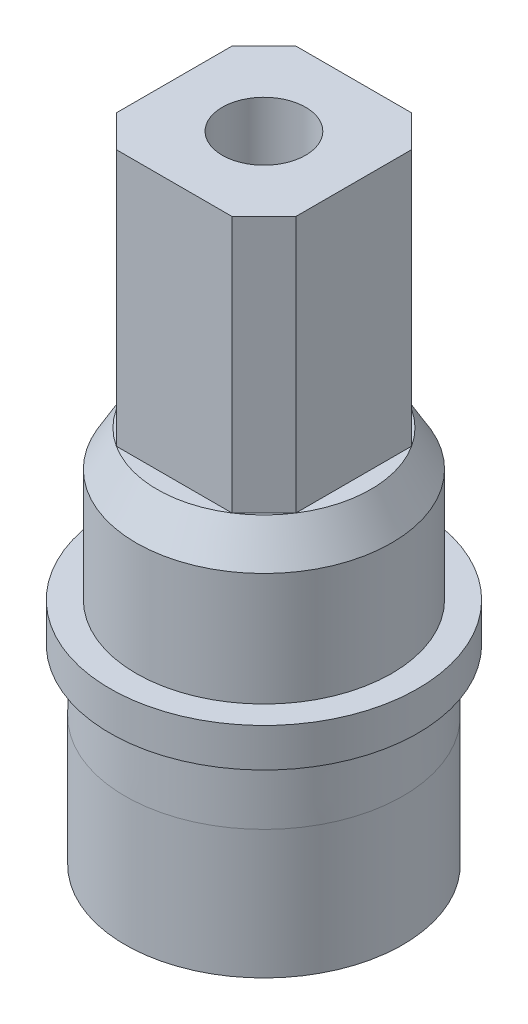
ISO-10303-21;
HEADER;
FILE_DESCRIPTION(('STEP AP214'),'2;1');
FILE_NAME('part.step','',(''),(''),'','','');
FILE_SCHEMA(('AUTOMOTIVE_DESIGN { 1 0 10303 214 1 1 1 1 }'));
ENDSEC;
DATA;
#1=APPLICATION_CONTEXT('core data for automotive mechanical design processes');
#2=APPLICATION_PROTOCOL_DEFINITION('international standard','automotive_design',2000,#1);
#3=PRODUCT_CONTEXT('',#1,'mechanical');
#4=PRODUCT('Part','Part','',(#3));
#5=PRODUCT_RELATED_PRODUCT_CATEGORY('part','',(#4));
#6=PRODUCT_DEFINITION_FORMATION('','',#4);
#7=PRODUCT_DEFINITION_CONTEXT('part definition',#1,'design');
#8=PRODUCT_DEFINITION('design','',#6,#7);
#9=PRODUCT_DEFINITION_SHAPE('','',#8);
#10=(LENGTH_UNIT() NAMED_UNIT(*) SI_UNIT(.MILLI.,.METRE.));
#11=(NAMED_UNIT(*) PLANE_ANGLE_UNIT() SI_UNIT($,.RADIAN.));
#12=(NAMED_UNIT(*) SI_UNIT($,.STERADIAN.) SOLID_ANGLE_UNIT());
#13=UNCERTAINTY_MEASURE_WITH_UNIT(LENGTH_MEASURE(1.E-05),#10,'distance_accuracy_value','');
#14=(GEOMETRIC_REPRESENTATION_CONTEXT(3) GLOBAL_UNCERTAINTY_ASSIGNED_CONTEXT((#13)) GLOBAL_UNIT_ASSIGNED_CONTEXT((#10,
#11,#12)) REPRESENTATION_CONTEXT('',''));
#15=CARTESIAN_POINT('',(0.,0.,0.));
#16=DIRECTION('',(0.,0.,1.));
#17=DIRECTION('',(1.,0.,0.));
#18=AXIS2_PLACEMENT_3D('',#15,#16,#17);
#19=CARTESIAN_POINT('',(0.,-7.46,0.));
#20=DIRECTION('',(0.,1.,0.));
#21=DIRECTION('',(0.,0.,1.));
#22=AXIS2_PLACEMENT_3D('',#19,#20,#21);
#23=CYLINDRICAL_SURFACE('',#22,4.315);
#24=CARTESIAN_POINT('',(0.,0.54,0.));
#25=DIRECTION('',(0.,-1.,0.));
#26=DIRECTION('',(0.,0.,-1.));
#27=AXIS2_PLACEMENT_3D('',#24,#25,#26);
#28=CIRCLE('',#27,4.315);
#29=CARTESIAN_POINT('',(0.,0.54,-4.315));
#30=VERTEX_POINT('',#29);
#31=EDGE_CURVE('E83',#30,#30,#28,.T.);
#32=ORIENTED_EDGE('',*,*,#31,.T.);
#33=EDGE_LOOP('',(#32));
#34=FACE_BOUND('',#33,.T.);
#35=CARTESIAN_POINT('',(0.,-3.46,0.));
#36=DIRECTION('',(0.,-1.,0.));
#37=DIRECTION('',(0.,0.,-1.));
#38=AXIS2_PLACEMENT_3D('',#35,#36,#37);
#39=CIRCLE('',#38,4.315);
#40=CARTESIAN_POINT('',(0.,-3.46,-4.315));
#41=VERTEX_POINT('',#40);
#42=EDGE_CURVE('E78',#41,#41,#39,.T.);
#43=ORIENTED_EDGE('',*,*,#42,.F.);
#44=EDGE_LOOP('',(#43));
#45=FACE_BOUND('',#44,.T.);
#46=ADVANCED_FACE('F44',(#34,#45),#23,.T.);
#47=CARTESIAN_POINT('',(0.089910847244246,2.74,-1.19662694251292));
#48=DIRECTION('',(0.0749257060368717,0.,-0.997189118760768));
#49=DIRECTION('',(-0.997189118760768,0.,-0.0749257060368717));
#50=AXIS2_PLACEMENT_3D('',#47,#48,#49);
#51=PLANE('',#50);
#52=DIRECTION('',(-0.997189118760768,0.,-0.0749257060368717));
#53=VECTOR('',#52,1.);
#54=CARTESIAN_POINT('',(0.089910847244246,-3.46,-1.19662694251292));
#55=LINE('',#54,#53);
#56=CARTESIAN_POINT('',(1.14523661458051,-3.46,-1.11733302852112));
#57=VERTEX_POINT('',#56);
#58=CARTESIAN_POINT('',(-0.965414920092013,-3.46,-1.27592085650472));
#59=VERTEX_POINT('',#58);
#60=EDGE_CURVE('E57',#57,#59,#55,.T.);
#61=ORIENTED_EDGE('',*,*,#60,.F.);
#62=DIRECTION('',(0.,-1.,0.));
#63=VECTOR('',#62,1.);
#64=CARTESIAN_POINT('',(1.1452366145805,2.74,-1.11733302852112));
#65=LINE('',#64,#63);
#66=CARTESIAN_POINT('',(1.1452366145805,0.54,-1.11733302852112));
#67=VERTEX_POINT('',#66);
#68=EDGE_CURVE('E77',#67,#57,#65,.T.);
#69=ORIENTED_EDGE('',*,*,#68,.F.);
#70=DIRECTION('',(0.997189118760768,0.,0.0749257060368717));
#71=VECTOR('',#70,1.);
#72=CARTESIAN_POINT('',(0.089910847244246,0.54,-1.19662694251292));
#73=LINE('',#72,#71);
#74=CARTESIAN_POINT('',(-0.965414920092012,0.54,-1.27592085650472));
#75=VERTEX_POINT('',#74);
#76=EDGE_CURVE('E12',#75,#67,#73,.T.);
#77=ORIENTED_EDGE('',*,*,#76,.F.);
#78=DIRECTION('',(0.,-1.,0.));
#79=VECTOR('',#78,1.);
#80=CARTESIAN_POINT('',(-0.965414920092013,2.74,-1.27592085650472));
#81=LINE('',#80,#79);
#82=EDGE_CURVE('E64',#75,#59,#81,.T.);
#83=ORIENTED_EDGE('',*,*,#82,.T.);
#84=EDGE_LOOP('',(#61,#69,#77,#83));
#85=FACE_BOUND('',#84,.T.);
#86=ADVANCED_FACE('F76',(#85),#51,.F.);
#87=CARTESIAN_POINT('',(0.,2.74,0.));
#88=DIRECTION('',(0.,-1.,0.));
#89=DIRECTION('',(0.,0.,-1.));
#90=AXIS2_PLACEMENT_3D('',#87,#88,#89);
#91=CYLINDRICAL_SURFACE('',#90,1.6);
#92=CARTESIAN_POINT('',(0.,-3.46,0.));
#93=DIRECTION('',(0.,-1.,0.));
#94=DIRECTION('',(0.,0.,-1.));
#95=AXIS2_PLACEMENT_3D('',#92,#93,#94);
#96=CIRCLE('',#95,1.6);
#97=EDGE_CURVE('E69',#57,#59,#96,.T.);
#98=ORIENTED_EDGE('',*,*,#97,.T.);
#99=ORIENTED_EDGE('',*,*,#82,.F.);
#100=CARTESIAN_POINT('',(0.,0.54,0.));
#101=DIRECTION('',(0.,-1.,0.));
#102=DIRECTION('',(0.,0.,-1.));
#103=AXIS2_PLACEMENT_3D('',#100,#101,#102);
#104=CIRCLE('',#103,1.6);
#105=EDGE_CURVE('E51',#67,#75,#104,.T.);
#106=ORIENTED_EDGE('',*,*,#105,.F.);
#107=ORIENTED_EDGE('',*,*,#68,.T.);
#108=EDGE_LOOP('',(#98,#99,#106,#107));
#109=FACE_BOUND('',#108,.T.);
#110=ADVANCED_FACE('F80',(#109),#91,.F.);
#111=CARTESIAN_POINT('',(0.,0.54,0.));
#112=DIRECTION('',(0.,-1.,0.));
#113=DIRECTION('',(0.,0.,-1.));
#114=AXIS2_PLACEMENT_3D('',#111,#112,#113);
#115=PLANE('',#114);
#116=ORIENTED_EDGE('',*,*,#105,.T.);
#117=ORIENTED_EDGE('',*,*,#76,.T.);
#118=EDGE_LOOP('',(#116,#117));
#119=FACE_BOUND('',#118,.T.);
#120=ORIENTED_EDGE('',*,*,#31,.F.);
#121=EDGE_LOOP('',(#120));
#122=FACE_BOUND('',#121,.T.);
#123=ADVANCED_FACE('F90',(#119,#122),#115,.F.);
#124=CARTESIAN_POINT('',(0.,-3.46,0.));
#125=DIRECTION('',(0.,-1.,0.));
#126=DIRECTION('',(0.,0.,-1.));
#127=AXIS2_PLACEMENT_3D('',#124,#125,#126);
#128=PLANE('',#127);
#129=ORIENTED_EDGE('',*,*,#97,.F.);
#130=ORIENTED_EDGE('',*,*,#60,.T.);
#131=EDGE_LOOP('',(#129,#130));
#132=FACE_BOUND('',#131,.T.);
#133=ORIENTED_EDGE('',*,*,#42,.T.);
#134=EDGE_LOOP('',(#133));
#135=FACE_BOUND('',#134,.T.);
#136=ADVANCED_FACE('F70',(#132,#135),#128,.T.);
#137=CLOSED_SHELL('',(#46,#86,#110,#123,#136));
#138=MANIFOLD_SOLID_BREP('B2',#137);
#139=CARTESIAN_POINT('',(0.,5.54,0.));
#140=DIRECTION('',(0.,-1.,0.));
#141=DIRECTION('',(0.,0.,-1.));
#142=AXIS2_PLACEMENT_3D('',#139,#140,#141);
#143=PLANE('',#142);
#144=DIRECTION('',(-0.997189118760768,0.,-0.0749257060368717));
#145=VECTOR('',#144,1.);
#146=CARTESIAN_POINT('',(0.089910847244246,5.54,-1.19662694251292));
#147=LINE('',#146,#145);
#148=CARTESIAN_POINT('',(0.575394497324978,5.54,-1.16014920266668));
#149=VERTEX_POINT('',#148);
#150=CARTESIAN_POINT('',(-0.395572802836486,5.54,-1.23310468235916));
#151=VERTEX_POINT('',#150);
#152=EDGE_CURVE('E240',#149,#151,#147,.T.);
#153=ORIENTED_EDGE('',*,*,#152,.F.);
#154=CARTESIAN_POINT('',(0.,5.54,0.));
#155=DIRECTION('',(0.,-1.,0.));
#156=DIRECTION('',(0.,0.,-1.));
#157=AXIS2_PLACEMENT_3D('',#154,#155,#156);
#158=CIRCLE('',#157,1.295);
#159=EDGE_CURVE('E276',#149,#151,#158,.F.);
#160=ORIENTED_EDGE('',*,*,#159,.T.);
#161=EDGE_LOOP('',(#153,#160));
#162=FACE_BOUND('',#161,.T.);
#163=ADVANCED_FACE('F139',(#162),#143,.F.);
#164=CARTESIAN_POINT('',(0.,0.,0.));
#165=DIRECTION('',(0.,-1.,0.));
#166=DIRECTION('',(0.,0.,-1.));
#167=AXIS2_PLACEMENT_3D('',#164,#165,#166);
#168=CYLINDRICAL_SURFACE('',#167,1.295);
#169=CARTESIAN_POINT('',(0.,16.2829292602701,0.));
#170=DIRECTION('',(0.,1.,0.));
#171=DIRECTION('',(0.,0.,1.));
#172=AXIS2_PLACEMENT_3D('',#169,#170,#171);
#173=CIRCLE('',#172,1.295);
#174=CARTESIAN_POINT('',(0.,16.2829292602701,1.295));
#175=VERTEX_POINT('',#174);
#176=EDGE_CURVE('E248',#175,#175,#173,.T.);
#177=ORIENTED_EDGE('',*,*,#176,.T.);
#178=EDGE_LOOP('',(#177));
#179=FACE_BOUND('',#178,.T.);
#180=DIRECTION('',(0.,-1.,0.));
#181=VECTOR('',#180,1.);
#182=CARTESIAN_POINT('',(-0.395572802836487,0.,-1.23310468235916));
#183=LINE('',#182,#181);
#184=CARTESIAN_POINT('',(-0.395572802836486,6.54,-1.23310468235916));
#185=VERTEX_POINT('',#184);
#186=EDGE_CURVE('E42',#151,#185,#183,.F.);
#187=ORIENTED_EDGE('',*,*,#186,.F.);
#188=ORIENTED_EDGE('',*,*,#159,.F.);
#189=DIRECTION('',(0.,-1.,0.));
#190=VECTOR('',#189,1.);
#191=CARTESIAN_POINT('',(0.575394497324978,0.,-1.16014920266668));
#192=LINE('',#191,#190);
#193=CARTESIAN_POINT('',(0.575394497324978,6.54,-1.16014920266668));
#194=VERTEX_POINT('',#193);
#195=EDGE_CURVE('E147',#194,#149,#192,.T.);
#196=ORIENTED_EDGE('',*,*,#195,.F.);
#197=CARTESIAN_POINT('',(0.,6.54,0.));
#198=DIRECTION('',(0.,-1.,0.));
#199=DIRECTION('',(0.,0.,-1.));
#200=AXIS2_PLACEMENT_3D('',#197,#198,#199);
#201=CIRCLE('',#200,1.295);
#202=EDGE_CURVE('E244',#185,#194,#201,.F.);
#203=ORIENTED_EDGE('',*,*,#202,.F.);
#204=EDGE_LOOP('',(#187,#188,#196,#203));
#205=FACE_BOUND('',#204,.T.);
#206=ADVANCED_FACE('F141',(#179,#205),#168,.F.);
#207=CARTESIAN_POINT('',(2.79,16.,-1.79952771581879));
#208=DIRECTION('',(-0.707106781186548,0.,0.707106781186548));
#209=DIRECTION('',(0.707106781186548,0.,0.707106781186548));
#210=AXIS2_PLACEMENT_3D('',#207,#208,#209);
#211=PLANE('',#210);
#212=DIRECTION('',(0.,-1.,0.));
#213=VECTOR('',#212,1.);
#214=CARTESIAN_POINT('',(1.79952771581879,16.,-2.79));
#215=LINE('',#214,#213);
#216=CARTESIAN_POINT('',(1.79952771581879,16.2829292602701,-2.79));
#217=VERTEX_POINT('',#216);
#218=CARTESIAN_POINT('',(1.79952771581879,8.3,-2.79));
#219=VERTEX_POINT('',#218);
#220=EDGE_CURVE('E317',#217,#219,#215,.T.);
#221=ORIENTED_EDGE('',*,*,#220,.F.);
#222=DIRECTION('',(-0.707106781186548,0.,-0.707106781186548));
#223=VECTOR('',#222,1.);
#224=CARTESIAN_POINT('',(1.79952771581879,16.2829292602701,-2.79));
#225=LINE('',#224,#223);
#226=CARTESIAN_POINT('',(2.79,16.2829292602701,-1.79952771581879));
#227=VERTEX_POINT('',#226);
#228=EDGE_CURVE('E263',#227,#217,#225,.T.);
#229=ORIENTED_EDGE('',*,*,#228,.F.);
#230=DIRECTION('',(0.,-1.,0.));
#231=VECTOR('',#230,1.);
#232=CARTESIAN_POINT('',(2.79,16.,-1.79952771581879));
#233=LINE('',#232,#231);
#234=CARTESIAN_POINT('',(2.79,8.3,-1.79952771581879));
#235=VERTEX_POINT('',#234);
#236=EDGE_CURVE('E303',#227,#235,#233,.T.);
#237=ORIENTED_EDGE('',*,*,#236,.T.);
#238=DIRECTION('',(-0.707106781186548,0.,-0.707106781186548));
#239=VECTOR('',#238,1.);
#240=CARTESIAN_POINT('',(2.79,8.3,-1.79952771581879));
#241=LINE('',#240,#239);
#242=EDGE_CURVE('E279',#235,#219,#241,.T.);
#243=ORIENTED_EDGE('',*,*,#242,.T.);
#244=EDGE_LOOP('',(#221,#229,#237,#243));
#245=FACE_BOUND('',#244,.T.);
#246=ADVANCED_FACE('F380',(#245),#211,.F.);
#247=CARTESIAN_POINT('',(1.79952771581879,16.,-2.79));
#248=DIRECTION('',(0.,0.,1.));
#249=DIRECTION('',(1.,0.,0.));
#250=AXIS2_PLACEMENT_3D('',#247,#248,#249);
#251=PLANE('',#250);
#252=DIRECTION('',(0.,-1.,0.));
#253=VECTOR('',#252,1.);
#254=CARTESIAN_POINT('',(-1.79952771581879,16.,-2.79));
#255=LINE('',#254,#253);
#256=CARTESIAN_POINT('',(-1.79952771581879,16.2829292602701,-2.79));
#257=VERTEX_POINT('',#256);
#258=CARTESIAN_POINT('',(-1.79952771581879,8.3,-2.79));
#259=VERTEX_POINT('',#258);
#260=EDGE_CURVE('E315',#257,#259,#255,.T.);
#261=ORIENTED_EDGE('',*,*,#260,.F.);
#262=DIRECTION('',(-1.,0.,0.));
#263=VECTOR('',#262,1.);
#264=CARTESIAN_POINT('',(-1.79952771581879,16.2829292602701,-2.79));
#265=LINE('',#264,#263);
#266=EDGE_CURVE('E266',#217,#257,#265,.T.);
#267=ORIENTED_EDGE('',*,*,#266,.F.);
#268=ORIENTED_EDGE('',*,*,#220,.T.);
#269=DIRECTION('',(-1.,0.,0.));
#270=VECTOR('',#269,1.);
#271=CARTESIAN_POINT('',(1.79952771581879,8.3,-2.79));
#272=LINE('',#271,#270);
#273=EDGE_CURVE('E282',#219,#259,#272,.T.);
#274=ORIENTED_EDGE('',*,*,#273,.T.);
#275=EDGE_LOOP('',(#261,#267,#268,#274));
#276=FACE_BOUND('',#275,.T.);
#277=ADVANCED_FACE('F402',(#276),#251,.F.);
#278=CARTESIAN_POINT('',(-1.79952771581879,16.,-2.79));
#279=DIRECTION('',(0.707106781186548,0.,0.707106781186548));
#280=DIRECTION('',(0.707106781186548,0.,-0.707106781186548));
#281=AXIS2_PLACEMENT_3D('',#278,#279,#280);
#282=PLANE('',#281);
#283=DIRECTION('',(0.,-1.,0.));
#284=VECTOR('',#283,1.);
#285=CARTESIAN_POINT('',(-2.79,16.,-1.79952771581879));
#286=LINE('',#285,#284);
#287=CARTESIAN_POINT('',(-2.79,16.2829292602701,-1.79952771581879));
#288=VERTEX_POINT('',#287);
#289=CARTESIAN_POINT('',(-2.79,8.3,-1.79952771581879));
#290=VERTEX_POINT('',#289);
#291=EDGE_CURVE('E313',#288,#290,#286,.T.);
#292=ORIENTED_EDGE('',*,*,#291,.F.);
#293=DIRECTION('',(-0.707106781186548,0.,0.707106781186548));
#294=VECTOR('',#293,1.);
#295=CARTESIAN_POINT('',(-2.79,16.2829292602701,-1.79952771581879));
#296=LINE('',#295,#294);
#297=EDGE_CURVE('E269',#257,#288,#296,.T.);
#298=ORIENTED_EDGE('',*,*,#297,.F.);
#299=ORIENTED_EDGE('',*,*,#260,.T.);
#300=DIRECTION('',(-0.707106781186548,0.,0.707106781186548));
#301=VECTOR('',#300,1.);
#302=CARTESIAN_POINT('',(-1.79952771581879,8.3,-2.79));
#303=LINE('',#302,#301);
#304=EDGE_CURVE('E285',#259,#290,#303,.T.);
#305=ORIENTED_EDGE('',*,*,#304,.T.);
#306=EDGE_LOOP('',(#292,#298,#299,#305));
#307=FACE_BOUND('',#306,.T.);
#308=ADVANCED_FACE('F398',(#307),#282,.F.);
#309=CARTESIAN_POINT('',(-2.79,16.,-1.79952771581879));
#310=DIRECTION('',(1.,0.,0.));
#311=DIRECTION('',(0.,0.,-1.));
#312=AXIS2_PLACEMENT_3D('',#309,#310,#311);
#313=PLANE('',#312);
#314=DIRECTION('',(0.,-1.,0.));
#315=VECTOR('',#314,1.);
#316=CARTESIAN_POINT('',(-2.79,16.,1.79952771581879));
#317=LINE('',#316,#315);
#318=CARTESIAN_POINT('',(-2.79,16.2829292602701,1.79952771581879));
#319=VERTEX_POINT('',#318);
#320=CARTESIAN_POINT('',(-2.79,8.3,1.79952771581879));
#321=VERTEX_POINT('',#320);
#322=EDGE_CURVE('E311',#319,#321,#317,.T.);
#323=ORIENTED_EDGE('',*,*,#322,.F.);
#324=DIRECTION('',(0.,0.,1.));
#325=VECTOR('',#324,1.);
#326=CARTESIAN_POINT('',(-2.79,16.2829292602701,1.79952771581879));
#327=LINE('',#326,#325);
#328=EDGE_CURVE('E236',#288,#319,#327,.T.);
#329=ORIENTED_EDGE('',*,*,#328,.F.);
#330=ORIENTED_EDGE('',*,*,#291,.T.);
#331=DIRECTION('',(0.,0.,1.));
#332=VECTOR('',#331,1.);
#333=CARTESIAN_POINT('',(-2.79,8.3,-1.79952771581879));
#334=LINE('',#333,#332);
#335=EDGE_CURVE('E288',#290,#321,#334,.T.);
#336=ORIENTED_EDGE('',*,*,#335,.T.);
#337=EDGE_LOOP('',(#323,#329,#330,#336));
#338=FACE_BOUND('',#337,.T.);
#339=ADVANCED_FACE('F394',(#338),#313,.F.);
#340=CARTESIAN_POINT('',(-2.79,16.,1.79952771581879));
#341=DIRECTION('',(0.707106781186548,0.,-0.707106781186548));
#342=DIRECTION('',(-0.707106781186548,0.,-0.707106781186548));
#343=AXIS2_PLACEMENT_3D('',#340,#341,#342);
#344=PLANE('',#343);
#345=DIRECTION('',(0.,-1.,0.));
#346=VECTOR('',#345,1.);
#347=CARTESIAN_POINT('',(-1.79952771581879,16.,2.79));
#348=LINE('',#347,#346);
#349=CARTESIAN_POINT('',(-1.79952771581879,16.2829292602701,2.79));
#350=VERTEX_POINT('',#349);
#351=CARTESIAN_POINT('',(-1.79952771581879,8.3,2.79));
#352=VERTEX_POINT('',#351);
#353=EDGE_CURVE('E309',#350,#352,#348,.T.);
#354=ORIENTED_EDGE('',*,*,#353,.F.);
#355=DIRECTION('',(0.707106781186548,0.,0.707106781186548));
#356=VECTOR('',#355,1.);
#357=CARTESIAN_POINT('',(-1.79952771581879,16.2829292602701,2.79));
#358=LINE('',#357,#356);
#359=EDGE_CURVE('E251',#319,#350,#358,.T.);
#360=ORIENTED_EDGE('',*,*,#359,.F.);
#361=ORIENTED_EDGE('',*,*,#322,.T.);
#362=DIRECTION('',(0.707106781186548,0.,0.707106781186548));
#363=VECTOR('',#362,1.);
#364=CARTESIAN_POINT('',(-2.79,8.3,1.79952771581879));
#365=LINE('',#364,#363);
#366=EDGE_CURVE('E291',#321,#352,#365,.T.);
#367=ORIENTED_EDGE('',*,*,#366,.T.);
#368=EDGE_LOOP('',(#354,#360,#361,#367));
#369=FACE_BOUND('',#368,.T.);
#370=ADVANCED_FACE('F390',(#369),#344,.F.);
#371=CARTESIAN_POINT('',(-1.79952771581879,16.,2.79));
#372=DIRECTION('',(0.,0.,-1.));
#373=DIRECTION('',(-1.,0.,0.));
#374=AXIS2_PLACEMENT_3D('',#371,#372,#373);
#375=PLANE('',#374);
#376=DIRECTION('',(0.,-1.,0.));
#377=VECTOR('',#376,1.);
#378=CARTESIAN_POINT('',(1.79952771581879,16.,2.79));
#379=LINE('',#378,#377);
#380=CARTESIAN_POINT('',(1.79952771581879,16.2829292602701,2.79));
#381=VERTEX_POINT('',#380);
#382=CARTESIAN_POINT('',(1.79952771581879,8.3,2.79));
#383=VERTEX_POINT('',#382);
#384=EDGE_CURVE('E307',#381,#383,#379,.T.);
#385=ORIENTED_EDGE('',*,*,#384,.F.);
#386=DIRECTION('',(1.,0.,0.));
#387=VECTOR('',#386,1.);
#388=CARTESIAN_POINT('',(1.79952771581879,16.2829292602701,2.79));
#389=LINE('',#388,#387);
#390=EDGE_CURVE('E254',#350,#381,#389,.T.);
#391=ORIENTED_EDGE('',*,*,#390,.F.);
#392=ORIENTED_EDGE('',*,*,#353,.T.);
#393=DIRECTION('',(1.,0.,0.));
#394=VECTOR('',#393,1.);
#395=CARTESIAN_POINT('',(-1.79952771581879,8.3,2.79));
#396=LINE('',#395,#394);
#397=EDGE_CURVE('E294',#352,#383,#396,.T.);
#398=ORIENTED_EDGE('',*,*,#397,.T.);
#399=EDGE_LOOP('',(#385,#391,#392,#398));
#400=FACE_BOUND('',#399,.T.);
#401=ADVANCED_FACE('F386',(#400),#375,.F.);
#402=CARTESIAN_POINT('',(1.79952771581879,16.,2.79));
#403=DIRECTION('',(-0.707106781186548,0.,-0.707106781186548));
#404=DIRECTION('',(-0.707106781186548,0.,0.707106781186548));
#405=AXIS2_PLACEMENT_3D('',#402,#403,#404);
#406=PLANE('',#405);
#407=DIRECTION('',(0.,-1.,0.));
#408=VECTOR('',#407,1.);
#409=CARTESIAN_POINT('',(2.79,16.,1.79952771581879));
#410=LINE('',#409,#408);
#411=CARTESIAN_POINT('',(2.79,16.2829292602701,1.79952771581879));
#412=VERTEX_POINT('',#411);
#413=CARTESIAN_POINT('',(2.79,8.3,1.79952771581879));
#414=VERTEX_POINT('',#413);
#415=EDGE_CURVE('E305',#412,#414,#410,.T.);
#416=ORIENTED_EDGE('',*,*,#415,.F.);
#417=DIRECTION('',(0.707106781186548,0.,-0.707106781186548));
#418=VECTOR('',#417,1.);
#419=CARTESIAN_POINT('',(2.79,16.2829292602701,1.79952771581879));
#420=LINE('',#419,#418);
#421=EDGE_CURVE('E257',#381,#412,#420,.T.);
#422=ORIENTED_EDGE('',*,*,#421,.F.);
#423=ORIENTED_EDGE('',*,*,#384,.T.);
#424=DIRECTION('',(0.707106781186548,0.,-0.707106781186548));
#425=VECTOR('',#424,1.);
#426=CARTESIAN_POINT('',(1.79952771581879,8.3,2.79));
#427=LINE('',#426,#425);
#428=EDGE_CURVE('E297',#383,#414,#427,.T.);
#429=ORIENTED_EDGE('',*,*,#428,.T.);
#430=EDGE_LOOP('',(#416,#422,#423,#429));
#431=FACE_BOUND('',#430,.T.);
#432=ADVANCED_FACE('F370',(#431),#406,.F.);
#433=CARTESIAN_POINT('',(2.79,16.,1.79952771581879));
#434=DIRECTION('',(-1.,0.,0.));
#435=DIRECTION('',(0.,0.,1.));
#436=AXIS2_PLACEMENT_3D('',#433,#434,#435);
#437=PLANE('',#436);
#438=ORIENTED_EDGE('',*,*,#236,.F.);
#439=DIRECTION('',(0.,0.,-1.));
#440=VECTOR('',#439,1.);
#441=CARTESIAN_POINT('',(2.79,16.2829292602701,-1.79952771581879));
#442=LINE('',#441,#440);
#443=EDGE_CURVE('E260',#412,#227,#442,.T.);
#444=ORIENTED_EDGE('',*,*,#443,.F.);
#445=ORIENTED_EDGE('',*,*,#415,.T.);
#446=DIRECTION('',(0.,0.,-1.));
#447=VECTOR('',#446,1.);
#448=CARTESIAN_POINT('',(2.79,8.3,1.79952771581879));
#449=LINE('',#448,#447);
#450=EDGE_CURVE('E300',#414,#235,#449,.T.);
#451=ORIENTED_EDGE('',*,*,#450,.T.);
#452=EDGE_LOOP('',(#438,#444,#445,#451));
#453=FACE_BOUND('',#452,.T.);
#454=ADVANCED_FACE('F360',(#453),#437,.F.);
#455=CARTESIAN_POINT('',(0.,2.47,0.));
#456=DIRECTION('',(0.,-1.,0.));
#457=DIRECTION('',(0.,0.,-1.));
#458=AXIS2_PLACEMENT_3D('',#455,#456,#457);
#459=CONICAL_SURFACE('',#458,4.28,0.018216608185291);
#460=CARTESIAN_POINT('',(0.,2.47,0.));
#461=DIRECTION('',(0.,-1.,0.));
#462=DIRECTION('',(0.,0.,-1.));
#463=AXIS2_PLACEMENT_3D('',#460,#461,#462);
#464=CIRCLE('',#463,4.28);
#465=CARTESIAN_POINT('',(0.,2.47,-4.28));
#466=VERTEX_POINT('',#465);
#467=EDGE_CURVE('E319',#466,#466,#464,.T.);
#468=ORIENTED_EDGE('',*,*,#467,.T.);
#469=EDGE_LOOP('',(#468));
#470=FACE_BOUND('',#469,.T.);
#471=CARTESIAN_POINT('',(0.,0.54,0.));
#472=DIRECTION('',(0.,-1.,0.));
#473=DIRECTION('',(0.,0.,-1.));
#474=AXIS2_PLACEMENT_3D('',#471,#472,#473);
#475=CIRCLE('',#474,4.31516194331984);
#476=CARTESIAN_POINT('',(0.,0.54,-4.31516194331984));
#477=VERTEX_POINT('',#476);
#478=EDGE_CURVE('E274',#477,#477,#475,.T.);
#479=ORIENTED_EDGE('',*,*,#478,.F.);
#480=EDGE_LOOP('',(#479));
#481=FACE_BOUND('',#480,.T.);
#482=ADVANCED_FACE('F357',(#470,#481),#459,.T.);
#483=CARTESIAN_POINT('',(-1.295,8.3,0.));
#484=DIRECTION('',(0.,-1.,0.));
#485=DIRECTION('',(0.,0.,-1.));
#486=AXIS2_PLACEMENT_3D('',#483,#484,#485);
#487=PLANE('',#486);
#488=ORIENTED_EDGE('',*,*,#242,.F.);
#489=CARTESIAN_POINT('',(0.,8.3,0.));
#490=DIRECTION('',(0.,-1.,0.));
#491=DIRECTION('',(0.,0.,-1.));
#492=AXIS2_PLACEMENT_3D('',#489,#490,#491);
#493=CIRCLE('',#492,3.32);
#494=EDGE_CURVE('E335',#219,#235,#493,.T.);
#495=ORIENTED_EDGE('',*,*,#494,.F.);
#496=EDGE_LOOP('',(#488,#495));
#497=FACE_BOUND('',#496,.T.);
#498=ADVANCED_FACE('F359',(#497),#487,.F.);
#499=ORIENTED_EDGE('',*,*,#450,.F.);
#500=EDGE_CURVE('E339',#235,#414,#493,.T.);
#501=ORIENTED_EDGE('',*,*,#500,.F.);
#502=EDGE_LOOP('',(#499,#501));
#503=FACE_BOUND('',#502,.T.);
#504=ADVANCED_FACE('F367',(#503),#487,.F.);
#505=ORIENTED_EDGE('',*,*,#428,.F.);
#506=EDGE_CURVE('E714',#414,#383,#493,.T.);
#507=ORIENTED_EDGE('',*,*,#506,.F.);
#508=EDGE_LOOP('',(#505,#507));
#509=FACE_BOUND('',#508,.T.);
#510=ADVANCED_FACE('F628',(#509),#487,.F.);
#511=ORIENTED_EDGE('',*,*,#397,.F.);
#512=EDGE_CURVE('E703',#383,#352,#493,.T.);
#513=ORIENTED_EDGE('',*,*,#512,.F.);
#514=EDGE_LOOP('',(#511,#513));
#515=FACE_BOUND('',#514,.T.);
#516=ADVANCED_FACE('F636',(#515),#487,.F.);
#517=ORIENTED_EDGE('',*,*,#366,.F.);
#518=EDGE_CURVE('E698',#352,#321,#493,.T.);
#519=ORIENTED_EDGE('',*,*,#518,.F.);
#520=EDGE_LOOP('',(#517,#519));
#521=FACE_BOUND('',#520,.T.);
#522=ADVANCED_FACE('F441',(#521),#487,.F.);
#523=ORIENTED_EDGE('',*,*,#335,.F.);
#524=EDGE_CURVE('E431',#321,#290,#493,.T.);
#525=ORIENTED_EDGE('',*,*,#524,.F.);
#526=EDGE_LOOP('',(#523,#525));
#527=FACE_BOUND('',#526,.T.);
#528=ADVANCED_FACE('F436',(#527),#487,.F.);
#529=ORIENTED_EDGE('',*,*,#304,.F.);
#530=EDGE_CURVE('E425',#290,#259,#493,.T.);
#531=ORIENTED_EDGE('',*,*,#530,.F.);
#532=EDGE_LOOP('',(#529,#531));
#533=FACE_BOUND('',#532,.T.);
#534=ADVANCED_FACE('F434',(#533),#487,.F.);
#535=ORIENTED_EDGE('',*,*,#273,.F.);
#536=EDGE_CURVE('E334',#259,#219,#493,.T.);
#537=ORIENTED_EDGE('',*,*,#536,.F.);
#538=EDGE_LOOP('',(#535,#537));
#539=FACE_BOUND('',#538,.T.);
#540=ADVANCED_FACE('F369',(#539),#487,.F.);
#541=CARTESIAN_POINT('',(0.,8.3,0.));
#542=DIRECTION('',(0.,-1.,0.));
#543=DIRECTION('',(0.,0.,-1.));
#544=AXIS2_PLACEMENT_3D('',#541,#542,#543);
#545=CONICAL_SURFACE('',#544,3.32,0.527554966909787);
#546=CARTESIAN_POINT('',(0.,7.18438312144079,0.));
#547=DIRECTION('',(0.,-1.,0.));
#548=DIRECTION('',(0.,0.,-1.));
#549=AXIS2_PLACEMENT_3D('',#546,#547,#548);
#550=CIRCLE('',#549,3.97);
#551=CARTESIAN_POINT('',(0.,7.18438312144079,-3.97));
#552=VERTEX_POINT('',#551);
#553=EDGE_CURVE('E331',#552,#552,#550,.T.);
#554=ORIENTED_EDGE('',*,*,#553,.F.);
#555=EDGE_LOOP('',(#554));
#556=FACE_BOUND('',#555,.T.);
#557=ORIENTED_EDGE('',*,*,#494,.T.);
#558=ORIENTED_EDGE('',*,*,#500,.T.);
#559=ORIENTED_EDGE('',*,*,#506,.T.);
#560=ORIENTED_EDGE('',*,*,#512,.T.);
#561=ORIENTED_EDGE('',*,*,#518,.T.);
#562=ORIENTED_EDGE('',*,*,#524,.T.);
#563=ORIENTED_EDGE('',*,*,#530,.T.);
#564=ORIENTED_EDGE('',*,*,#536,.T.);
#565=EDGE_LOOP('',(#557,#558,#559,#560,#561,#562,#563,#564));
#566=FACE_BOUND('',#565,.T.);
#567=ADVANCED_FACE('F427',(#556,#566),#545,.T.);
#568=CARTESIAN_POINT('',(0.,0.,0.));
#569=DIRECTION('',(0.,-1.,0.));
#570=DIRECTION('',(0.,0.,-1.));
#571=AXIS2_PLACEMENT_3D('',#568,#569,#570);
#572=CYLINDRICAL_SURFACE('',#571,3.97);
#573=CARTESIAN_POINT('',(0.,3.67,0.));
#574=DIRECTION('',(0.,-1.,0.));
#575=DIRECTION('',(0.,0.,-1.));
#576=AXIS2_PLACEMENT_3D('',#573,#574,#575);
#577=CIRCLE('',#576,3.97);
#578=CARTESIAN_POINT('',(0.,3.67,-3.97));
#579=VERTEX_POINT('',#578);
#580=EDGE_CURVE('E328',#579,#579,#577,.T.);
#581=ORIENTED_EDGE('',*,*,#580,.F.);
#582=EDGE_LOOP('',(#581));
#583=FACE_BOUND('',#582,.T.);
#584=ORIENTED_EDGE('',*,*,#553,.T.);
#585=EDGE_LOOP('',(#584));
#586=FACE_BOUND('',#585,.T.);
#587=ADVANCED_FACE('F446',(#583,#586),#572,.T.);
#588=CARTESIAN_POINT('',(-3.97,3.67,0.));
#589=DIRECTION('',(0.,-1.,0.));
#590=DIRECTION('',(0.,0.,-1.));
#591=AXIS2_PLACEMENT_3D('',#588,#589,#590);
#592=PLANE('',#591);
#593=CARTESIAN_POINT('',(0.,3.67,0.));
#594=DIRECTION('',(0.,-1.,0.));
#595=DIRECTION('',(0.,0.,-1.));
#596=AXIS2_PLACEMENT_3D('',#593,#594,#595);
#597=CIRCLE('',#596,4.785);
#598=CARTESIAN_POINT('',(0.,3.67,-4.785));
#599=VERTEX_POINT('',#598);
#600=EDGE_CURVE('E325',#599,#599,#597,.T.);
#601=ORIENTED_EDGE('',*,*,#600,.F.);
#602=EDGE_LOOP('',(#601));
#603=FACE_BOUND('',#602,.T.);
#604=ORIENTED_EDGE('',*,*,#580,.T.);
#605=EDGE_LOOP('',(#604));
#606=FACE_BOUND('',#605,.T.);
#607=ADVANCED_FACE('F450',(#603,#606),#592,.F.);
#608=CARTESIAN_POINT('',(0.,0.,0.));
#609=DIRECTION('',(0.,-1.,0.));
#610=DIRECTION('',(0.,0.,-1.));
#611=AXIS2_PLACEMENT_3D('',#608,#609,#610);
#612=CYLINDRICAL_SURFACE('',#611,4.785);
#613=CARTESIAN_POINT('',(0.,2.47,0.));
#614=DIRECTION('',(0.,-1.,0.));
#615=DIRECTION('',(0.,0.,-1.));
#616=AXIS2_PLACEMENT_3D('',#613,#614,#615);
#617=CIRCLE('',#616,4.785);
#618=CARTESIAN_POINT('',(0.,2.47,-4.785));
#619=VERTEX_POINT('',#618);
#620=EDGE_CURVE('E322',#619,#619,#617,.T.);
#621=ORIENTED_EDGE('',*,*,#620,.F.);
#622=EDGE_LOOP('',(#621));
#623=FACE_BOUND('',#622,.T.);
#624=ORIENTED_EDGE('',*,*,#600,.T.);
#625=EDGE_LOOP('',(#624));
#626=FACE_BOUND('',#625,.T.);
#627=ADVANCED_FACE('F454',(#623,#626),#612,.T.);
#628=CARTESIAN_POINT('',(-4.785,2.47,0.));
#629=DIRECTION('',(0.,1.,0.));
#630=DIRECTION('',(0.,0.,1.));
#631=AXIS2_PLACEMENT_3D('',#628,#629,#630);
#632=PLANE('',#631);
#633=ORIENTED_EDGE('',*,*,#467,.F.);
#634=EDGE_LOOP('',(#633));
#635=FACE_BOUND('',#634,.T.);
#636=ORIENTED_EDGE('',*,*,#620,.T.);
#637=EDGE_LOOP('',(#636));
#638=FACE_BOUND('',#637,.T.);
#639=ADVANCED_FACE('F353',(#635,#638),#632,.F.);
#640=CARTESIAN_POINT('',(0.,0.54,0.));
#641=DIRECTION('',(0.,-1.,0.));
#642=DIRECTION('',(0.,0.,-1.));
#643=AXIS2_PLACEMENT_3D('',#640,#641,#642);
#644=PLANE('',#643);
#645=DIRECTION('',(0.997189118760768,0.,0.0749257060368717));
#646=VECTOR('',#645,1.);
#647=CARTESIAN_POINT('',(0.089910847244246,0.54,-1.19662694251292));
#648=LINE('',#647,#646);
#649=CARTESIAN_POINT('',(-0.965414920092013,0.54,-1.27592085650472));
#650=VERTEX_POINT('',#649);
#651=CARTESIAN_POINT('',(1.1452366145805,0.54,-1.11733302852112));
#652=VERTEX_POINT('',#651);
#653=EDGE_CURVE('E233',#650,#652,#648,.T.);
#654=ORIENTED_EDGE('',*,*,#653,.F.);
#655=CARTESIAN_POINT('',(0.,0.54,0.));
#656=DIRECTION('',(0.,-1.,0.));
#657=DIRECTION('',(0.,0.,-1.));
#658=AXIS2_PLACEMENT_3D('',#655,#656,#657);
#659=CIRCLE('',#658,1.6);
#660=EDGE_CURVE('E338',#652,#650,#659,.T.);
#661=ORIENTED_EDGE('',*,*,#660,.F.);
#662=EDGE_LOOP('',(#654,#661));
#663=FACE_BOUND('',#662,.T.);
#664=ORIENTED_EDGE('',*,*,#478,.T.);
#665=EDGE_LOOP('',(#664));
#666=FACE_BOUND('',#665,.T.);
#667=ADVANCED_FACE('F350',(#663,#666),#644,.T.);
#668=CARTESIAN_POINT('',(0.089910847244246,2.74,-1.19662694251292));
#669=DIRECTION('',(0.0749257060368717,0.,-0.997189118760768));
#670=DIRECTION('',(-0.997189118760768,0.,-0.0749257060368717));
#671=AXIS2_PLACEMENT_3D('',#668,#669,#670);
#672=PLANE('',#671);
#673=ORIENTED_EDGE('',*,*,#653,.T.);
#674=DIRECTION('',(0.,-1.,0.));
#675=VECTOR('',#674,1.);
#676=CARTESIAN_POINT('',(1.1452366145805,2.74,-1.11733302852112));
#677=LINE('',#676,#675);
#678=CARTESIAN_POINT('',(1.14523661458051,6.54,-1.11733302852112));
#679=VERTEX_POINT('',#678);
#680=EDGE_CURVE('E161',#679,#652,#677,.T.);
#681=ORIENTED_EDGE('',*,*,#680,.F.);
#682=DIRECTION('',(-0.997189118760768,0.,-0.0749257060368717));
#683=VECTOR('',#682,1.);
#684=CARTESIAN_POINT('',(0.089910847244246,6.54,-1.19662694251292));
#685=LINE('',#684,#683);
#686=EDGE_CURVE('E229',#679,#194,#685,.T.);
#687=ORIENTED_EDGE('',*,*,#686,.T.);
#688=ORIENTED_EDGE('',*,*,#195,.T.);
#689=ORIENTED_EDGE('',*,*,#152,.T.);
#690=ORIENTED_EDGE('',*,*,#186,.T.);
#691=CARTESIAN_POINT('',(-0.965414920092013,6.54,-1.27592085650472));
#692=VERTEX_POINT('',#691);
#693=EDGE_CURVE('E154',#185,#692,#685,.T.);
#694=ORIENTED_EDGE('',*,*,#693,.T.);
#695=DIRECTION('',(0.,-1.,0.));
#696=VECTOR('',#695,1.);
#697=CARTESIAN_POINT('',(-0.965414920092013,2.74,-1.27592085650472));
#698=LINE('',#697,#696);
#699=EDGE_CURVE('E235',#692,#650,#698,.T.);
#700=ORIENTED_EDGE('',*,*,#699,.T.);
#701=EDGE_LOOP('',(#673,#681,#687,#688,#689,#690,#694,#700));
#702=FACE_BOUND('',#701,.T.);
#703=ADVANCED_FACE('F227',(#702),#672,.F.);
#704=CARTESIAN_POINT('',(0.,2.74,0.));
#705=DIRECTION('',(0.,-1.,0.));
#706=DIRECTION('',(0.,0.,-1.));
#707=AXIS2_PLACEMENT_3D('',#704,#705,#706);
#708=CYLINDRICAL_SURFACE('',#707,1.6);
#709=ORIENTED_EDGE('',*,*,#660,.T.);
#710=ORIENTED_EDGE('',*,*,#699,.F.);
#711=CARTESIAN_POINT('',(0.,6.54,0.));
#712=DIRECTION('',(0.,-1.,0.));
#713=DIRECTION('',(0.,0.,-1.));
#714=AXIS2_PLACEMENT_3D('',#711,#712,#713);
#715=CIRCLE('',#714,1.6);
#716=EDGE_CURVE('E238',#692,#679,#715,.F.);
#717=ORIENTED_EDGE('',*,*,#716,.T.);
#718=ORIENTED_EDGE('',*,*,#680,.T.);
#719=EDGE_LOOP('',(#709,#710,#717,#718));
#720=FACE_BOUND('',#719,.T.);
#721=ADVANCED_FACE('F239',(#720),#708,.F.);
#722=CARTESIAN_POINT('',(0.,16.2829292602701,0.));
#723=DIRECTION('',(0.,-1.,0.));
#724=DIRECTION('',(0.,0.,-1.));
#725=AXIS2_PLACEMENT_3D('',#722,#723,#724);
#726=PLANE('',#725);
#727=ORIENTED_EDGE('',*,*,#359,.T.);
#728=ORIENTED_EDGE('',*,*,#390,.T.);
#729=ORIENTED_EDGE('',*,*,#421,.T.);
#730=ORIENTED_EDGE('',*,*,#443,.T.);
#731=ORIENTED_EDGE('',*,*,#228,.T.);
#732=ORIENTED_EDGE('',*,*,#266,.T.);
#733=ORIENTED_EDGE('',*,*,#297,.T.);
#734=ORIENTED_EDGE('',*,*,#328,.T.);
#735=EDGE_LOOP('',(#727,#728,#729,#730,#731,#732,#733,#734));
#736=FACE_BOUND('',#735,.T.);
#737=ORIENTED_EDGE('',*,*,#176,.F.);
#738=EDGE_LOOP('',(#737));
#739=FACE_BOUND('',#738,.T.);
#740=ADVANCED_FACE('F415',(#736,#739),#726,.F.);
#741=CARTESIAN_POINT('',(0.,6.54,0.));
#742=DIRECTION('',(0.,-1.,0.));
#743=DIRECTION('',(0.,0.,-1.));
#744=AXIS2_PLACEMENT_3D('',#741,#742,#743);
#745=PLANE('',#744);
#746=ORIENTED_EDGE('',*,*,#202,.T.);
#747=ORIENTED_EDGE('',*,*,#686,.F.);
#748=ORIENTED_EDGE('',*,*,#716,.F.);
#749=ORIENTED_EDGE('',*,*,#693,.F.);
#750=EDGE_LOOP('',(#746,#747,#748,#749));
#751=FACE_BOUND('',#750,.T.);
#752=ADVANCED_FACE('F242',(#751),#745,.T.);
#753=CLOSED_SHELL('',(#163,#206,#246,#277,#308,#339,#370,#401,#432,#454,#482,#498,#504,#510,
#516,#522,#528,#534,#540,#567,#587,#607,#627,#639,#667,#703,#721,#740,#752));
#754=MANIFOLD_SOLID_BREP('B6',#753);
#755=ADVANCED_BREP_SHAPE_REPRESENTATION('',(#18,#138,#754),#14);
#756=SHAPE_DEFINITION_REPRESENTATION(#9,#755);
ENDSEC;
END-ISO-10303-21;
